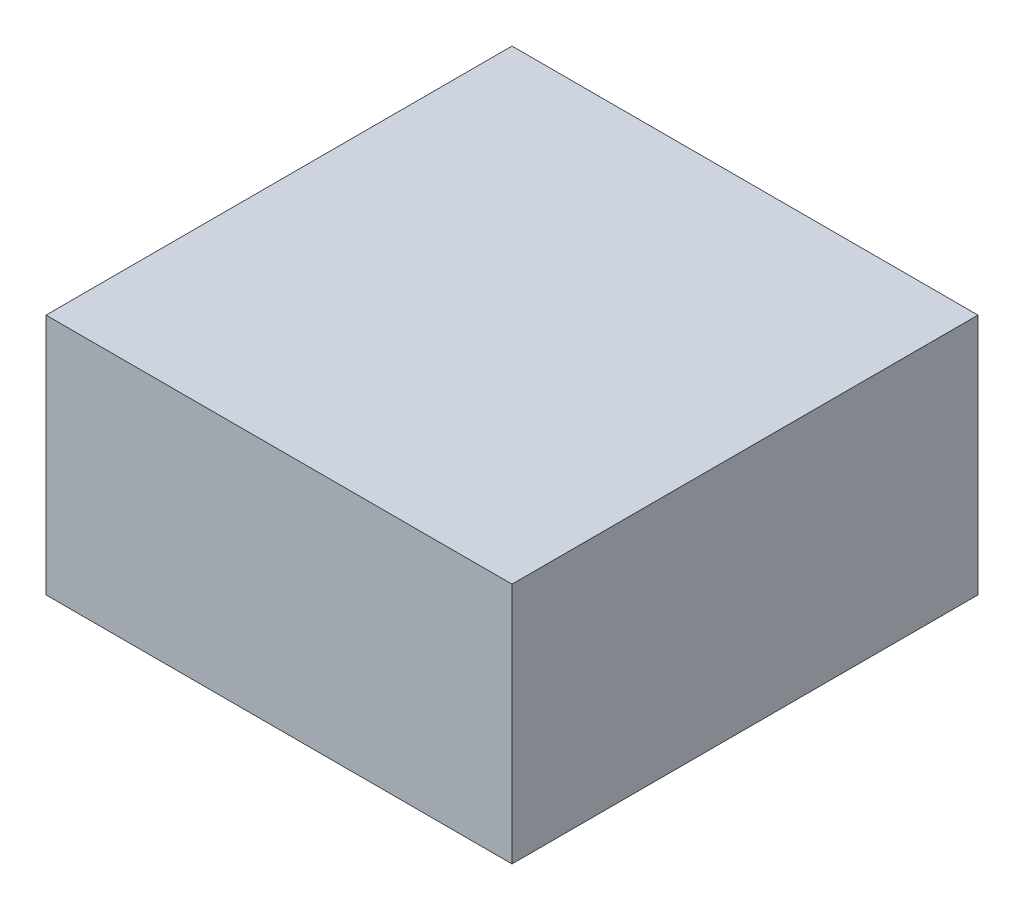
ISO-10303-21;
HEADER;
FILE_DESCRIPTION(('STEP AP214'),'2;1');
FILE_NAME('part.step','',(''),(''),'','','');
FILE_SCHEMA(('AUTOMOTIVE_DESIGN { 1 0 10303 214 1 1 1 1 }'));
ENDSEC;
DATA;
#1=APPLICATION_CONTEXT('core data for automotive mechanical design processes');
#2=APPLICATION_PROTOCOL_DEFINITION('international standard','automotive_design',2000,#1);
#3=PRODUCT_CONTEXT('',#1,'mechanical');
#4=PRODUCT('Part','Part','',(#3));
#5=PRODUCT_RELATED_PRODUCT_CATEGORY('part','',(#4));
#6=PRODUCT_DEFINITION_FORMATION('','',#4);
#7=PRODUCT_DEFINITION_CONTEXT('part definition',#1,'design');
#8=PRODUCT_DEFINITION('design','',#6,#7);
#9=PRODUCT_DEFINITION_SHAPE('','',#8);
#10=(LENGTH_UNIT() NAMED_UNIT(*) SI_UNIT(.MILLI.,.METRE.));
#11=(NAMED_UNIT(*) PLANE_ANGLE_UNIT() SI_UNIT($,.RADIAN.));
#12=(NAMED_UNIT(*) SI_UNIT($,.STERADIAN.) SOLID_ANGLE_UNIT());
#13=UNCERTAINTY_MEASURE_WITH_UNIT(LENGTH_MEASURE(1.E-05),#10,'distance_accuracy_value','');
#14=(GEOMETRIC_REPRESENTATION_CONTEXT(3) GLOBAL_UNCERTAINTY_ASSIGNED_CONTEXT((#13)) GLOBAL_UNIT_ASSIGNED_CONTEXT((#10,
#11,#12)) REPRESENTATION_CONTEXT('',''));
#15=CARTESIAN_POINT('',(0.,0.,0.));
#16=DIRECTION('',(0.,0.,1.));
#17=DIRECTION('',(1.,0.,0.));
#18=AXIS2_PLACEMENT_3D('',#15,#16,#17);
#19=CARTESIAN_POINT('',(0.,13.,0.));
#20=DIRECTION('',(-1.,0.,0.));
#21=DIRECTION('',(0.,0.,1.));
#22=AXIS2_PLACEMENT_3D('',#19,#20,#21);
#23=PLANE('',#22);
#24=DIRECTION('',(0.,0.,-1.));
#25=VECTOR('',#24,1.);
#26=CARTESIAN_POINT('',(0.,0.,0.));
#27=LINE('',#26,#25);
#28=CARTESIAN_POINT('',(0.,0.,0.));
#29=VERTEX_POINT('',#28);
#30=CARTESIAN_POINT('',(0.,0.,-25.));
#31=VERTEX_POINT('',#30);
#32=EDGE_CURVE('E101',#29,#31,#27,.T.);
#33=ORIENTED_EDGE('',*,*,#32,.F.);
#34=DIRECTION('',(0.,-1.,0.));
#35=VECTOR('',#34,1.);
#36=CARTESIAN_POINT('',(0.,13.,0.));
#37=LINE('',#36,#35);
#38=CARTESIAN_POINT('',(0.,13.,0.));
#39=VERTEX_POINT('',#38);
#40=EDGE_CURVE('E11',#39,#29,#37,.T.);
#41=ORIENTED_EDGE('',*,*,#40,.F.);
#42=DIRECTION('',(0.,0.,-1.));
#43=VECTOR('',#42,1.);
#44=CARTESIAN_POINT('',(0.,13.,0.));
#45=LINE('',#44,#43);
#46=CARTESIAN_POINT('',(0.,13.,-25.));
#47=VERTEX_POINT('',#46);
#48=EDGE_CURVE('E96',#39,#47,#45,.T.);
#49=ORIENTED_EDGE('',*,*,#48,.T.);
#50=DIRECTION('',(0.,-1.,0.));
#51=VECTOR('',#50,1.);
#52=CARTESIAN_POINT('',(0.,13.,-25.));
#53=LINE('',#52,#51);
#54=EDGE_CURVE('E39',#47,#31,#53,.T.);
#55=ORIENTED_EDGE('',*,*,#54,.T.);
#56=EDGE_LOOP('',(#33,#41,#49,#55));
#57=FACE_BOUND('',#56,.T.);
#58=ADVANCED_FACE('F36',(#57),#23,.T.);
#59=CARTESIAN_POINT('',(0.,13.,0.));
#60=DIRECTION('',(0.,0.,-1.));
#61=DIRECTION('',(-1.,0.,0.));
#62=AXIS2_PLACEMENT_3D('',#59,#60,#61);
#63=PLANE('',#62);
#64=DIRECTION('',(1.,0.,0.));
#65=VECTOR('',#64,1.);
#66=CARTESIAN_POINT('',(0.,0.,0.));
#67=LINE('',#66,#65);
#68=CARTESIAN_POINT('',(25.,0.,0.));
#69=VERTEX_POINT('',#68);
#70=EDGE_CURVE('E69',#29,#69,#67,.T.);
#71=ORIENTED_EDGE('',*,*,#70,.T.);
#72=DIRECTION('',(0.,-1.,0.));
#73=VECTOR('',#72,1.);
#74=CARTESIAN_POINT('',(25.,13.,0.));
#75=LINE('',#74,#73);
#76=CARTESIAN_POINT('',(25.,13.,0.));
#77=VERTEX_POINT('',#76);
#78=EDGE_CURVE('E45',#77,#69,#75,.T.);
#79=ORIENTED_EDGE('',*,*,#78,.F.);
#80=DIRECTION('',(1.,0.,0.));
#81=VECTOR('',#80,1.);
#82=CARTESIAN_POINT('',(0.,13.,0.));
#83=LINE('',#82,#81);
#84=EDGE_CURVE('E86',#39,#77,#83,.T.);
#85=ORIENTED_EDGE('',*,*,#84,.F.);
#86=ORIENTED_EDGE('',*,*,#40,.T.);
#87=EDGE_LOOP('',(#71,#79,#85,#86));
#88=FACE_BOUND('',#87,.T.);
#89=ADVANCED_FACE('F111',(#88),#63,.F.);
#90=CARTESIAN_POINT('',(25.,13.,0.));
#91=DIRECTION('',(-1.,0.,0.));
#92=DIRECTION('',(0.,0.,1.));
#93=AXIS2_PLACEMENT_3D('',#90,#91,#92);
#94=PLANE('',#93);
#95=DIRECTION('',(0.,0.,-1.));
#96=VECTOR('',#95,1.);
#97=CARTESIAN_POINT('',(25.,0.,0.));
#98=LINE('',#97,#96);
#99=CARTESIAN_POINT('',(25.,0.,-25.));
#100=VERTEX_POINT('',#99);
#101=EDGE_CURVE('E93',#69,#100,#98,.T.);
#102=ORIENTED_EDGE('',*,*,#101,.T.);
#103=DIRECTION('',(0.,-1.,0.));
#104=VECTOR('',#103,1.);
#105=CARTESIAN_POINT('',(25.,13.,-25.));
#106=LINE('',#105,#104);
#107=CARTESIAN_POINT('',(25.,13.,-25.));
#108=VERTEX_POINT('',#107);
#109=EDGE_CURVE('E90',#108,#100,#106,.T.);
#110=ORIENTED_EDGE('',*,*,#109,.F.);
#111=DIRECTION('',(0.,0.,-1.));
#112=VECTOR('',#111,1.);
#113=CARTESIAN_POINT('',(25.,13.,0.));
#114=LINE('',#113,#112);
#115=EDGE_CURVE('E81',#77,#108,#114,.T.);
#116=ORIENTED_EDGE('',*,*,#115,.F.);
#117=ORIENTED_EDGE('',*,*,#78,.T.);
#118=EDGE_LOOP('',(#102,#110,#116,#117));
#119=FACE_BOUND('',#118,.T.);
#120=ADVANCED_FACE('F91',(#119),#94,.F.);
#121=CARTESIAN_POINT('',(0.,13.,-25.));
#122=DIRECTION('',(0.,0.,-1.));
#123=DIRECTION('',(-1.,0.,0.));
#124=AXIS2_PLACEMENT_3D('',#121,#122,#123);
#125=PLANE('',#124);
#126=DIRECTION('',(1.,0.,0.));
#127=VECTOR('',#126,1.);
#128=CARTESIAN_POINT('',(0.,0.,-25.));
#129=LINE('',#128,#127);
#130=EDGE_CURVE('E104',#31,#100,#129,.T.);
#131=ORIENTED_EDGE('',*,*,#130,.F.);
#132=ORIENTED_EDGE('',*,*,#54,.F.);
#133=DIRECTION('',(1.,0.,0.));
#134=VECTOR('',#133,1.);
#135=CARTESIAN_POINT('',(0.,13.,-25.));
#136=LINE('',#135,#134);
#137=EDGE_CURVE('E85',#47,#108,#136,.T.);
#138=ORIENTED_EDGE('',*,*,#137,.T.);
#139=ORIENTED_EDGE('',*,*,#109,.T.);
#140=EDGE_LOOP('',(#131,#132,#138,#139));
#141=FACE_BOUND('',#140,.T.);
#142=ADVANCED_FACE('F95',(#141),#125,.T.);
#143=CARTESIAN_POINT('',(0.,13.,0.));
#144=DIRECTION('',(0.,-1.,0.));
#145=DIRECTION('',(0.,0.,-1.));
#146=AXIS2_PLACEMENT_3D('',#143,#144,#145);
#147=PLANE('',#146);
#148=ORIENTED_EDGE('',*,*,#48,.F.);
#149=ORIENTED_EDGE('',*,*,#84,.T.);
#150=ORIENTED_EDGE('',*,*,#115,.T.);
#151=ORIENTED_EDGE('',*,*,#137,.F.);
#152=EDGE_LOOP('',(#148,#149,#150,#151));
#153=FACE_BOUND('',#152,.T.);
#154=ADVANCED_FACE('F84',(#153),#147,.F.);
#155=CARTESIAN_POINT('',(0.,0.,0.));
#156=DIRECTION('',(0.,-1.,0.));
#157=DIRECTION('',(0.,0.,-1.));
#158=AXIS2_PLACEMENT_3D('',#155,#156,#157);
#159=PLANE('',#158);
#160=ORIENTED_EDGE('',*,*,#32,.T.);
#161=ORIENTED_EDGE('',*,*,#130,.T.);
#162=ORIENTED_EDGE('',*,*,#101,.F.);
#163=ORIENTED_EDGE('',*,*,#70,.F.);
#164=EDGE_LOOP('',(#160,#161,#162,#163));
#165=FACE_BOUND('',#164,.T.);
#166=ADVANCED_FACE('F109',(#165),#159,.T.);
#167=CLOSED_SHELL('',(#58,#89,#120,#142,#154,#166));
#168=MANIFOLD_SOLID_BREP('B2',#167);
#169=ADVANCED_BREP_SHAPE_REPRESENTATION('',(#18,#168),#14);
#170=SHAPE_DEFINITION_REPRESENTATION(#9,#169);
ENDSEC;
END-ISO-10303-21;
